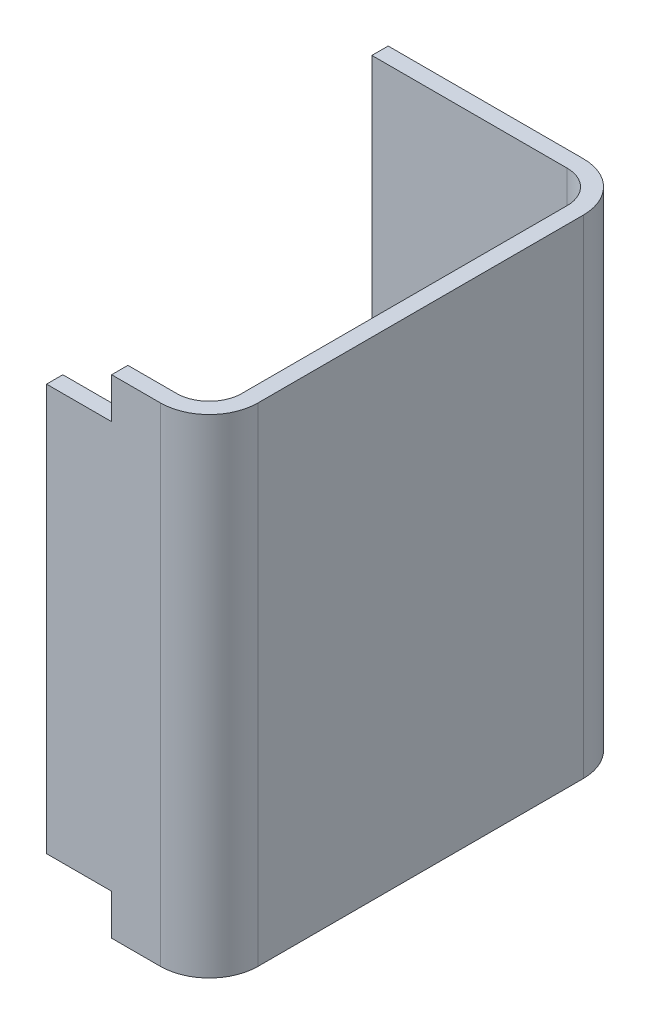
ISO-10303-21;
HEADER;
FILE_DESCRIPTION(('STEP AP214'),'2;1');
FILE_NAME('part.step','',(''),(''),'','','');
FILE_SCHEMA(('AUTOMOTIVE_DESIGN { 1 0 10303 214 1 1 1 1 }'));
ENDSEC;
DATA;
#1=APPLICATION_CONTEXT('core data for automotive mechanical design processes');
#2=APPLICATION_PROTOCOL_DEFINITION('international standard','automotive_design',2000,#1);
#3=PRODUCT_CONTEXT('',#1,'mechanical');
#4=PRODUCT('Part','Part','',(#3));
#5=PRODUCT_RELATED_PRODUCT_CATEGORY('part','',(#4));
#6=PRODUCT_DEFINITION_FORMATION('','',#4);
#7=PRODUCT_DEFINITION_CONTEXT('part definition',#1,'design');
#8=PRODUCT_DEFINITION('design','',#6,#7);
#9=PRODUCT_DEFINITION_SHAPE('','',#8);
#10=(LENGTH_UNIT() NAMED_UNIT(*) SI_UNIT(.MILLI.,.METRE.));
#11=(NAMED_UNIT(*) PLANE_ANGLE_UNIT() SI_UNIT($,.RADIAN.));
#12=(NAMED_UNIT(*) SI_UNIT($,.STERADIAN.) SOLID_ANGLE_UNIT());
#13=UNCERTAINTY_MEASURE_WITH_UNIT(LENGTH_MEASURE(1.E-05),#10,'distance_accuracy_value','');
#14=(GEOMETRIC_REPRESENTATION_CONTEXT(3) GLOBAL_UNCERTAINTY_ASSIGNED_CONTEXT((#13)) GLOBAL_UNIT_ASSIGNED_CONTEXT((#10,
#11,#12)) REPRESENTATION_CONTEXT('',''));
#15=CARTESIAN_POINT('',(0.,0.,0.));
#16=DIRECTION('',(0.,0.,1.));
#17=DIRECTION('',(1.,0.,0.));
#18=AXIS2_PLACEMENT_3D('',#15,#16,#17);
#19=CARTESIAN_POINT('',(0.2,-0.125,0.26));
#20=DIRECTION('',(0.,1.,0.));
#21=DIRECTION('',(1.,0.,0.));
#22=AXIS2_PLACEMENT_3D('',#19,#20,#21);
#23=PLANE('',#22);
#24=DIRECTION('',(-1.,0.,0.));
#25=VECTOR('',#24,1.);
#26=CARTESIAN_POINT('',(-0.045,-0.125,0.25));
#27=LINE('',#26,#25);
#28=CARTESIAN_POINT('',(0.24,-0.125,0.25));
#29=VERTEX_POINT('',#28);
#30=CARTESIAN_POINT('',(0.2,-0.125,0.25));
#31=VERTEX_POINT('',#30);
#32=EDGE_CURVE('E11',#29,#31,#27,.T.);
#33=ORIENTED_EDGE('',*,*,#32,.F.);
#34=DIRECTION('',(0.,0.,-1.));
#35=VECTOR('',#34,1.);
#36=CARTESIAN_POINT('',(0.24,-0.125,0.26));
#37=LINE('',#36,#35);
#38=CARTESIAN_POINT('',(0.24,-0.125,0.26));
#39=VERTEX_POINT('',#38);
#40=EDGE_CURVE('E24',#39,#29,#37,.T.);
#41=ORIENTED_EDGE('',*,*,#40,.F.);
#42=DIRECTION('',(1.,0.,0.));
#43=VECTOR('',#42,1.);
#44=CARTESIAN_POINT('',(0.1,-0.125,0.26));
#45=LINE('',#44,#43);
#46=CARTESIAN_POINT('',(0.2,-0.125,0.26));
#47=VERTEX_POINT('',#46);
#48=EDGE_CURVE('E260',#47,#39,#45,.T.);
#49=ORIENTED_EDGE('',*,*,#48,.F.);
#50=DIRECTION('',(0.,0.,1.));
#51=VECTOR('',#50,1.);
#52=CARTESIAN_POINT('',(0.2,-0.125,0.26));
#53=LINE('',#52,#51);
#54=EDGE_CURVE('E257',#31,#47,#53,.T.);
#55=ORIENTED_EDGE('',*,*,#54,.F.);
#56=EDGE_LOOP('',(#33,#41,#49,#55));
#57=FACE_BOUND('',#56,.T.);
#58=ADVANCED_FACE('F17',(#57),#23,.F.);
#59=CARTESIAN_POINT('',(0.24,-0.125,0.26));
#60=DIRECTION('',(1.,0.,0.));
#61=DIRECTION('',(0.,-1.,0.));
#62=AXIS2_PLACEMENT_3D('',#59,#60,#61);
#63=PLANE('',#62);
#64=DIRECTION('',(0.,1.,0.));
#65=VECTOR('',#64,1.);
#66=CARTESIAN_POINT('',(0.24,0.0125,0.25));
#67=LINE('',#66,#65);
#68=CARTESIAN_POINT('',(0.24,-0.15,0.25));
#69=VERTEX_POINT('',#68);
#70=EDGE_CURVE('E255',#69,#29,#67,.T.);
#71=ORIENTED_EDGE('',*,*,#70,.F.);
#72=DIRECTION('',(0.,0.,-1.));
#73=VECTOR('',#72,1.);
#74=CARTESIAN_POINT('',(0.24,-0.15,0.13));
#75=LINE('',#74,#73);
#76=CARTESIAN_POINT('',(0.24,-0.15,0.26));
#77=VERTEX_POINT('',#76);
#78=EDGE_CURVE('E252',#77,#69,#75,.T.);
#79=ORIENTED_EDGE('',*,*,#78,.F.);
#80=DIRECTION('',(0.,-1.,0.));
#81=VECTOR('',#80,1.);
#82=CARTESIAN_POINT('',(0.24,-0.0625,0.26));
#83=LINE('',#82,#81);
#84=EDGE_CURVE('E249',#39,#77,#83,.T.);
#85=ORIENTED_EDGE('',*,*,#84,.F.);
#86=ORIENTED_EDGE('',*,*,#40,.T.);
#87=EDGE_LOOP('',(#71,#79,#85,#86));
#88=FACE_BOUND('',#87,.T.);
#89=ADVANCED_FACE('F264',(#88),#63,.F.);
#90=CARTESIAN_POINT('',(0.24,0.125,0.26));
#91=DIRECTION('',(0.,-1.,0.));
#92=DIRECTION('',(-1.,0.,0.));
#93=AXIS2_PLACEMENT_3D('',#90,#91,#92);
#94=PLANE('',#93);
#95=DIRECTION('',(1.,0.,0.));
#96=VECTOR('',#95,1.);
#97=CARTESIAN_POINT('',(-0.025,0.125,0.25));
#98=LINE('',#97,#96);
#99=CARTESIAN_POINT('',(0.2,0.125,0.25));
#100=VERTEX_POINT('',#99);
#101=CARTESIAN_POINT('',(0.24,0.125,0.25));
#102=VERTEX_POINT('',#101);
#103=EDGE_CURVE('E247',#100,#102,#98,.T.);
#104=ORIENTED_EDGE('',*,*,#103,.F.);
#105=DIRECTION('',(0.,0.,-1.));
#106=VECTOR('',#105,1.);
#107=CARTESIAN_POINT('',(0.2,0.125,0.26));
#108=LINE('',#107,#106);
#109=CARTESIAN_POINT('',(0.2,0.125,0.26));
#110=VERTEX_POINT('',#109);
#111=EDGE_CURVE('E244',#110,#100,#108,.T.);
#112=ORIENTED_EDGE('',*,*,#111,.F.);
#113=DIRECTION('',(-1.,0.,0.));
#114=VECTOR('',#113,1.);
#115=CARTESIAN_POINT('',(0.12,0.125,0.26));
#116=LINE('',#115,#114);
#117=CARTESIAN_POINT('',(0.24,0.125,0.26));
#118=VERTEX_POINT('',#117);
#119=EDGE_CURVE('E241',#118,#110,#116,.T.);
#120=ORIENTED_EDGE('',*,*,#119,.F.);
#121=DIRECTION('',(0.,0.,-1.));
#122=VECTOR('',#121,1.);
#123=CARTESIAN_POINT('',(0.24,0.125,0.26));
#124=LINE('',#123,#122);
#125=EDGE_CURVE('E238',#118,#102,#124,.T.);
#126=ORIENTED_EDGE('',*,*,#125,.T.);
#127=EDGE_LOOP('',(#104,#112,#120,#126));
#128=FACE_BOUND('',#127,.T.);
#129=ADVANCED_FACE('F305',(#128),#94,.F.);
#130=CARTESIAN_POINT('',(0.24,0.15,0.26));
#131=DIRECTION('',(1.,0.,0.));
#132=DIRECTION('',(0.,-1.,0.));
#133=AXIS2_PLACEMENT_3D('',#130,#131,#132);
#134=PLANE('',#133);
#135=DIRECTION('',(0.,1.,0.));
#136=VECTOR('',#135,1.);
#137=CARTESIAN_POINT('',(0.24,0.149999999999999,0.25));
#138=LINE('',#137,#136);
#139=CARTESIAN_POINT('',(0.24,0.15,0.25));
#140=VERTEX_POINT('',#139);
#141=EDGE_CURVE('E236',#102,#140,#138,.T.);
#142=ORIENTED_EDGE('',*,*,#141,.F.);
#143=ORIENTED_EDGE('',*,*,#125,.F.);
#144=DIRECTION('',(0.,-1.,0.));
#145=VECTOR('',#144,1.);
#146=CARTESIAN_POINT('',(0.24,0.0749999999999997,0.26));
#147=LINE('',#146,#145);
#148=CARTESIAN_POINT('',(0.24,0.15,0.26));
#149=VERTEX_POINT('',#148);
#150=EDGE_CURVE('E233',#149,#118,#147,.T.);
#151=ORIENTED_EDGE('',*,*,#150,.F.);
#152=DIRECTION('',(0.,0.,1.));
#153=VECTOR('',#152,1.);
#154=CARTESIAN_POINT('',(0.24,0.15,0.13));
#155=LINE('',#154,#153);
#156=EDGE_CURVE('E231',#140,#149,#155,.T.);
#157=ORIENTED_EDGE('',*,*,#156,.F.);
#158=EDGE_LOOP('',(#142,#143,#151,#157));
#159=FACE_BOUND('',#158,.T.);
#160=ADVANCED_FACE('F307',(#159),#134,.F.);
#161=CARTESIAN_POINT('',(-0.3,-0.15,0.));
#162=DIRECTION('',(0.,-1.,0.));
#163=DIRECTION('',(1.,0.,0.));
#164=AXIS2_PLACEMENT_3D('',#161,#162,#163);
#165=PLANE('',#164);
#166=ORIENTED_EDGE('',*,*,#78,.T.);
#167=DIRECTION('',(1.,0.,0.));
#168=VECTOR('',#167,1.);
#169=CARTESIAN_POINT('',(-0.295,-0.15,0.25));
#170=LINE('',#169,#168);
#171=CARTESIAN_POINT('',(0.27,-0.15,0.25));
#172=VERTEX_POINT('',#171);
#173=EDGE_CURVE('E229',#69,#172,#170,.T.);
#174=ORIENTED_EDGE('',*,*,#173,.T.);
#175=CARTESIAN_POINT('',(0.27,-0.15,0.23));
#176=DIRECTION('',(0.,-1.,0.));
#177=DIRECTION('',(0.707106781186548,0.,0.707106781186548));
#178=AXIS2_PLACEMENT_3D('',#175,#176,#177);
#179=CIRCLE('',#178,0.02);
#180=CARTESIAN_POINT('',(0.29,-0.15,0.23));
#181=VERTEX_POINT('',#180);
#182=EDGE_CURVE('E226',#181,#172,#179,.T.);
#183=ORIENTED_EDGE('',*,*,#182,.F.);
#184=DIRECTION('',(0.,0.,-1.));
#185=VECTOR('',#184,1.);
#186=CARTESIAN_POINT('',(0.29,-0.15,0.125));
#187=LINE('',#186,#185);
#188=CARTESIAN_POINT('',(0.29,-0.15,0.03));
#189=VERTEX_POINT('',#188);
#190=EDGE_CURVE('E224',#181,#189,#187,.T.);
#191=ORIENTED_EDGE('',*,*,#190,.T.);
#192=CARTESIAN_POINT('',(0.27,-0.15,0.03));
#193=DIRECTION('',(0.,-1.,0.));
#194=DIRECTION('',(0.707106781186548,0.,-0.707106781186547));
#195=AXIS2_PLACEMENT_3D('',#192,#193,#194);
#196=CIRCLE('',#195,0.02);
#197=CARTESIAN_POINT('',(0.27,-0.15,0.01));
#198=VERTEX_POINT('',#197);
#199=EDGE_CURVE('E221',#198,#189,#196,.T.);
#200=ORIENTED_EDGE('',*,*,#199,.F.);
#201=DIRECTION('',(-1.,0.,0.));
#202=VECTOR('',#201,1.);
#203=CARTESIAN_POINT('',(-0.005,-0.15,0.0100000000000001));
#204=LINE('',#203,#202);
#205=CARTESIAN_POINT('',(0.15,-0.15,0.01));
#206=VERTEX_POINT('',#205);
#207=EDGE_CURVE('E219',#198,#206,#204,.T.);
#208=ORIENTED_EDGE('',*,*,#207,.T.);
#209=DIRECTION('',(0.,0.,-1.));
#210=VECTOR('',#209,1.);
#211=CARTESIAN_POINT('',(0.15,-0.15,0.));
#212=LINE('',#211,#210);
#213=CARTESIAN_POINT('',(0.15,-0.15,0.));
#214=VERTEX_POINT('',#213);
#215=EDGE_CURVE('E217',#206,#214,#212,.T.);
#216=ORIENTED_EDGE('',*,*,#215,.T.);
#217=DIRECTION('',(1.,0.,0.));
#218=VECTOR('',#217,1.);
#219=CARTESIAN_POINT('',(-0.3,-0.15,0.));
#220=LINE('',#219,#218);
#221=CARTESIAN_POINT('',(0.27,-0.15,0.));
#222=VERTEX_POINT('',#221);
#223=EDGE_CURVE('E144',#214,#222,#220,.T.);
#224=ORIENTED_EDGE('',*,*,#223,.T.);
#225=CARTESIAN_POINT('',(0.27,-0.15,0.03));
#226=DIRECTION('',(0.,1.,0.));
#227=DIRECTION('',(0.707106781186547,0.,-0.707106781186548));
#228=AXIS2_PLACEMENT_3D('',#225,#226,#227);
#229=CIRCLE('',#228,0.03);
#230=CARTESIAN_POINT('',(0.3,-0.15,0.03));
#231=VERTEX_POINT('',#230);
#232=EDGE_CURVE('E213',#231,#222,#229,.T.);
#233=ORIENTED_EDGE('',*,*,#232,.F.);
#234=DIRECTION('',(0.,0.,1.));
#235=VECTOR('',#234,1.);
#236=CARTESIAN_POINT('',(0.3,-0.15,0.));
#237=LINE('',#236,#235);
#238=CARTESIAN_POINT('',(0.3,-0.15,0.23));
#239=VERTEX_POINT('',#238);
#240=EDGE_CURVE('E211',#231,#239,#237,.T.);
#241=ORIENTED_EDGE('',*,*,#240,.T.);
#242=CARTESIAN_POINT('',(0.27,-0.15,0.23));
#243=DIRECTION('',(0.,1.,0.));
#244=DIRECTION('',(0.707106781186548,0.,0.707106781186548));
#245=AXIS2_PLACEMENT_3D('',#242,#243,#244);
#246=CIRCLE('',#245,0.03);
#247=CARTESIAN_POINT('',(0.27,-0.15,0.26));
#248=VERTEX_POINT('',#247);
#249=EDGE_CURVE('E208',#248,#239,#246,.T.);
#250=ORIENTED_EDGE('',*,*,#249,.F.);
#251=DIRECTION('',(1.,0.,0.));
#252=VECTOR('',#251,1.);
#253=CARTESIAN_POINT('',(-0.3,-0.15,0.26));
#254=LINE('',#253,#252);
#255=EDGE_CURVE('E205',#77,#248,#254,.T.);
#256=ORIENTED_EDGE('',*,*,#255,.F.);
#257=EDGE_LOOP('',(#166,#174,#183,#191,#200,#208,#216,#224,#233,#241,#250,#256));
#258=FACE_BOUND('',#257,.T.);
#259=ADVANCED_FACE('F270',(#258),#165,.T.);
#260=CARTESIAN_POINT('',(0.2,0.184006542055292,0.26));
#261=DIRECTION('',(1.,0.,0.));
#262=DIRECTION('',(0.,-1.,0.));
#263=AXIS2_PLACEMENT_3D('',#260,#261,#262);
#264=PLANE('',#263);
#265=ORIENTED_EDGE('',*,*,#54,.T.);
#266=DIRECTION('',(0.,-1.,0.));
#267=VECTOR('',#266,1.);
#268=CARTESIAN_POINT('',(0.2,0.0920032710276462,0.26));
#269=LINE('',#268,#267);
#270=EDGE_CURVE('E202',#110,#47,#269,.T.);
#271=ORIENTED_EDGE('',*,*,#270,.F.);
#272=ORIENTED_EDGE('',*,*,#111,.T.);
#273=DIRECTION('',(0.,-1.,0.));
#274=VECTOR('',#273,1.);
#275=CARTESIAN_POINT('',(0.2,-0.184006542055292,0.25));
#276=LINE('',#275,#274);
#277=EDGE_CURVE('E199',#100,#31,#276,.T.);
#278=ORIENTED_EDGE('',*,*,#277,.T.);
#279=EDGE_LOOP('',(#265,#271,#272,#278));
#280=FACE_BOUND('',#279,.T.);
#281=ADVANCED_FACE('F300',(#280),#264,.F.);
#282=CARTESIAN_POINT('',(0.27,-0.075,0.03));
#283=DIRECTION('',(0.,1.,0.));
#284=DIRECTION('',(0.707106781186547,0.,-0.707106781186548));
#285=AXIS2_PLACEMENT_3D('',#282,#283,#284);
#286=CYLINDRICAL_SURFACE('',#285,0.03);
#287=CARTESIAN_POINT('',(0.27,0.15,0.03));
#288=DIRECTION('',(0.,-1.,0.));
#289=DIRECTION('',(0.707106781186547,0.,-0.707106781186548));
#290=AXIS2_PLACEMENT_3D('',#287,#288,#289);
#291=CIRCLE('',#290,0.03);
#292=CARTESIAN_POINT('',(0.27,0.15,0.));
#293=VERTEX_POINT('',#292);
#294=CARTESIAN_POINT('',(0.3,0.15,0.03));
#295=VERTEX_POINT('',#294);
#296=EDGE_CURVE('E149',#293,#295,#291,.T.);
#297=ORIENTED_EDGE('',*,*,#296,.T.);
#298=DIRECTION('',(0.,-1.,0.));
#299=VECTOR('',#298,1.);
#300=CARTESIAN_POINT('',(0.3,-0.075,0.03));
#301=LINE('',#300,#299);
#302=EDGE_CURVE('E195',#295,#231,#301,.T.);
#303=ORIENTED_EDGE('',*,*,#302,.T.);
#304=ORIENTED_EDGE('',*,*,#232,.T.);
#305=DIRECTION('',(0.,1.,0.));
#306=VECTOR('',#305,1.);
#307=CARTESIAN_POINT('',(0.27,-0.075,0.));
#308=LINE('',#307,#306);
#309=EDGE_CURVE('E193',#222,#293,#308,.T.);
#310=ORIENTED_EDGE('',*,*,#309,.T.);
#311=EDGE_LOOP('',(#297,#303,#304,#310));
#312=FACE_BOUND('',#311,.T.);
#313=ADVANCED_FACE('F286',(#312),#286,.T.);
#314=CARTESIAN_POINT('',(0.3,-0.15,0.));
#315=DIRECTION('',(1.,0.,0.));
#316=DIRECTION('',(0.,1.,0.));
#317=AXIS2_PLACEMENT_3D('',#314,#315,#316);
#318=PLANE('',#317);
#319=ORIENTED_EDGE('',*,*,#302,.F.);
#320=DIRECTION('',(0.,0.,1.));
#321=VECTOR('',#320,1.);
#322=CARTESIAN_POINT('',(0.3,0.15,0.));
#323=LINE('',#322,#321);
#324=CARTESIAN_POINT('',(0.3,0.15,0.23));
#325=VERTEX_POINT('',#324);
#326=EDGE_CURVE('E191',#295,#325,#323,.T.);
#327=ORIENTED_EDGE('',*,*,#326,.T.);
#328=DIRECTION('',(0.,1.,0.));
#329=VECTOR('',#328,1.);
#330=CARTESIAN_POINT('',(0.3,-0.075,0.23));
#331=LINE('',#330,#329);
#332=EDGE_CURVE('E188',#239,#325,#331,.T.);
#333=ORIENTED_EDGE('',*,*,#332,.F.);
#334=ORIENTED_EDGE('',*,*,#240,.F.);
#335=EDGE_LOOP('',(#319,#327,#333,#334));
#336=FACE_BOUND('',#335,.T.);
#337=ADVANCED_FACE('F289',(#336),#318,.T.);
#338=CARTESIAN_POINT('',(0.27,-0.075,0.23));
#339=DIRECTION('',(0.,1.,0.));
#340=DIRECTION('',(0.707106781186548,0.,0.707106781186548));
#341=AXIS2_PLACEMENT_3D('',#338,#339,#340);
#342=CYLINDRICAL_SURFACE('',#341,0.03);
#343=CARTESIAN_POINT('',(0.27,0.15,0.23));
#344=DIRECTION('',(0.,-1.,0.));
#345=DIRECTION('',(0.707106781186548,0.,0.707106781186548));
#346=AXIS2_PLACEMENT_3D('',#343,#344,#345);
#347=CIRCLE('',#346,0.03);
#348=CARTESIAN_POINT('',(0.27,0.15,0.26));
#349=VERTEX_POINT('',#348);
#350=EDGE_CURVE('E186',#325,#349,#347,.T.);
#351=ORIENTED_EDGE('',*,*,#350,.T.);
#352=DIRECTION('',(0.,-1.,0.));
#353=VECTOR('',#352,1.);
#354=CARTESIAN_POINT('',(0.27,-0.075,0.26));
#355=LINE('',#354,#353);
#356=EDGE_CURVE('E183',#349,#248,#355,.T.);
#357=ORIENTED_EDGE('',*,*,#356,.T.);
#358=ORIENTED_EDGE('',*,*,#249,.T.);
#359=ORIENTED_EDGE('',*,*,#332,.T.);
#360=EDGE_LOOP('',(#351,#357,#358,#359));
#361=FACE_BOUND('',#360,.T.);
#362=ADVANCED_FACE('F295',(#361),#342,.T.);
#363=CARTESIAN_POINT('',(0.27,0.15,0.23));
#364=DIRECTION('',(0.,1.,0.));
#365=DIRECTION('',(0.707106781186548,0.,0.707106781186548));
#366=AXIS2_PLACEMENT_3D('',#363,#364,#365);
#367=CYLINDRICAL_SURFACE('',#366,0.02);
#368=ORIENTED_EDGE('',*,*,#182,.T.);
#369=DIRECTION('',(0.,1.,0.));
#370=VECTOR('',#369,1.);
#371=CARTESIAN_POINT('',(0.27,0.15,0.25));
#372=LINE('',#371,#370);
#373=CARTESIAN_POINT('',(0.27,0.15,0.25));
#374=VERTEX_POINT('',#373);
#375=EDGE_CURVE('E180',#172,#374,#372,.T.);
#376=ORIENTED_EDGE('',*,*,#375,.T.);
#377=CARTESIAN_POINT('',(0.27,0.15,0.23));
#378=DIRECTION('',(0.,1.,0.));
#379=DIRECTION('',(0.707106781186548,0.,0.707106781186548));
#380=AXIS2_PLACEMENT_3D('',#377,#378,#379);
#381=CIRCLE('',#380,0.02);
#382=CARTESIAN_POINT('',(0.29,0.15,0.23));
#383=VERTEX_POINT('',#382);
#384=EDGE_CURVE('E177',#374,#383,#381,.T.);
#385=ORIENTED_EDGE('',*,*,#384,.T.);
#386=DIRECTION('',(0.,-1.,0.));
#387=VECTOR('',#386,1.);
#388=CARTESIAN_POINT('',(0.29,0.15,0.23));
#389=LINE('',#388,#387);
#390=EDGE_CURVE('E174',#383,#181,#389,.T.);
#391=ORIENTED_EDGE('',*,*,#390,.T.);
#392=EDGE_LOOP('',(#368,#376,#385,#391));
#393=FACE_BOUND('',#392,.T.);
#394=ADVANCED_FACE('F274',(#393),#367,.F.);
#395=CARTESIAN_POINT('',(-0.29,0.15,0.25));
#396=DIRECTION('',(0.,0.,1.));
#397=DIRECTION('',(1.,0.,0.));
#398=AXIS2_PLACEMENT_3D('',#395,#396,#397);
#399=PLANE('',#398);
#400=ORIENTED_EDGE('',*,*,#32,.T.);
#401=ORIENTED_EDGE('',*,*,#277,.F.);
#402=ORIENTED_EDGE('',*,*,#103,.T.);
#403=ORIENTED_EDGE('',*,*,#141,.T.);
#404=DIRECTION('',(-1.,0.,0.));
#405=VECTOR('',#404,1.);
#406=CARTESIAN_POINT('',(0.00500000000000001,0.15,0.25));
#407=LINE('',#406,#405);
#408=EDGE_CURVE('E171',#374,#140,#407,.T.);
#409=ORIENTED_EDGE('',*,*,#408,.F.);
#410=ORIENTED_EDGE('',*,*,#375,.F.);
#411=ORIENTED_EDGE('',*,*,#173,.F.);
#412=ORIENTED_EDGE('',*,*,#70,.T.);
#413=EDGE_LOOP('',(#400,#401,#402,#403,#409,#410,#411,#412));
#414=FACE_BOUND('',#413,.T.);
#415=ADVANCED_FACE('F266',(#414),#399,.F.);
#416=CARTESIAN_POINT('',(0.27,0.15,0.03));
#417=DIRECTION('',(0.,1.,0.));
#418=DIRECTION('',(0.707106781186548,0.,-0.707106781186547));
#419=AXIS2_PLACEMENT_3D('',#416,#417,#418);
#420=CYLINDRICAL_SURFACE('',#419,0.02);
#421=ORIENTED_EDGE('',*,*,#199,.T.);
#422=DIRECTION('',(0.,1.,0.));
#423=VECTOR('',#422,1.);
#424=CARTESIAN_POINT('',(0.29,0.15,0.03));
#425=LINE('',#424,#423);
#426=CARTESIAN_POINT('',(0.29,0.15,0.03));
#427=VERTEX_POINT('',#426);
#428=EDGE_CURVE('E168',#189,#427,#425,.T.);
#429=ORIENTED_EDGE('',*,*,#428,.T.);
#430=CARTESIAN_POINT('',(0.27,0.15,0.03));
#431=DIRECTION('',(0.,1.,0.));
#432=DIRECTION('',(0.707106781186548,0.,-0.707106781186547));
#433=AXIS2_PLACEMENT_3D('',#430,#431,#432);
#434=CIRCLE('',#433,0.02);
#435=CARTESIAN_POINT('',(0.27,0.15,0.01));
#436=VERTEX_POINT('',#435);
#437=EDGE_CURVE('E165',#427,#436,#434,.T.);
#438=ORIENTED_EDGE('',*,*,#437,.T.);
#439=DIRECTION('',(0.,-1.,0.));
#440=VECTOR('',#439,1.);
#441=CARTESIAN_POINT('',(0.27,0.15,0.01));
#442=LINE('',#441,#440);
#443=EDGE_CURVE('E162',#436,#198,#442,.T.);
#444=ORIENTED_EDGE('',*,*,#443,.T.);
#445=EDGE_LOOP('',(#421,#429,#438,#444));
#446=FACE_BOUND('',#445,.T.);
#447=ADVANCED_FACE('F281',(#446),#420,.F.);
#448=CARTESIAN_POINT('',(0.29,0.15,0.25));
#449=DIRECTION('',(1.,0.,0.));
#450=DIRECTION('',(0.,0.,-1.));
#451=AXIS2_PLACEMENT_3D('',#448,#449,#450);
#452=PLANE('',#451);
#453=ORIENTED_EDGE('',*,*,#390,.F.);
#454=DIRECTION('',(0.,0.,1.));
#455=VECTOR('',#454,1.);
#456=CARTESIAN_POINT('',(0.29,0.15,0.125));
#457=LINE('',#456,#455);
#458=EDGE_CURVE('E159',#427,#383,#457,.T.);
#459=ORIENTED_EDGE('',*,*,#458,.F.);
#460=ORIENTED_EDGE('',*,*,#428,.F.);
#461=ORIENTED_EDGE('',*,*,#190,.F.);
#462=EDGE_LOOP('',(#453,#459,#460,#461));
#463=FACE_BOUND('',#462,.T.);
#464=ADVANCED_FACE('F277',(#463),#452,.F.);
#465=CARTESIAN_POINT('',(0.29,0.15,0.01));
#466=DIRECTION('',(0.,0.,-1.));
#467=DIRECTION('',(-1.,0.,0.));
#468=AXIS2_PLACEMENT_3D('',#465,#466,#467);
#469=PLANE('',#468);
#470=ORIENTED_EDGE('',*,*,#207,.F.);
#471=ORIENTED_EDGE('',*,*,#443,.F.);
#472=DIRECTION('',(1.,0.,0.));
#473=VECTOR('',#472,1.);
#474=CARTESIAN_POINT('',(0.295,0.15,0.01));
#475=LINE('',#474,#473);
#476=CARTESIAN_POINT('',(0.15,0.15,0.01));
#477=VERTEX_POINT('',#476);
#478=EDGE_CURVE('E157',#477,#436,#475,.T.);
#479=ORIENTED_EDGE('',*,*,#478,.F.);
#480=DIRECTION('',(0.,1.,0.));
#481=VECTOR('',#480,1.);
#482=CARTESIAN_POINT('',(0.15,-0.187514999002179,0.01));
#483=LINE('',#482,#481);
#484=EDGE_CURVE('E133',#206,#477,#483,.T.);
#485=ORIENTED_EDGE('',*,*,#484,.F.);
#486=EDGE_LOOP('',(#470,#471,#479,#485));
#487=FACE_BOUND('',#486,.T.);
#488=ADVANCED_FACE('F283',(#487),#469,.F.);
#489=CARTESIAN_POINT('',(0.15,-0.187514999002179,0.));
#490=DIRECTION('',(1.,0.,0.));
#491=DIRECTION('',(0.,1.,0.));
#492=AXIS2_PLACEMENT_3D('',#489,#490,#491);
#493=PLANE('',#492);
#494=ORIENTED_EDGE('',*,*,#215,.F.);
#495=ORIENTED_EDGE('',*,*,#484,.T.);
#496=DIRECTION('',(0.,0.,1.));
#497=VECTOR('',#496,1.);
#498=CARTESIAN_POINT('',(0.15,0.15,0.));
#499=LINE('',#498,#497);
#500=CARTESIAN_POINT('',(0.15,0.15,0.));
#501=VERTEX_POINT('',#500);
#502=EDGE_CURVE('E127',#501,#477,#499,.T.);
#503=ORIENTED_EDGE('',*,*,#502,.F.);
#504=DIRECTION('',(0.,1.,0.));
#505=VECTOR('',#504,1.);
#506=CARTESIAN_POINT('',(0.15,-0.0937574995010894,0.));
#507=LINE('',#506,#505);
#508=EDGE_CURVE('E131',#214,#501,#507,.T.);
#509=ORIENTED_EDGE('',*,*,#508,.F.);
#510=EDGE_LOOP('',(#494,#495,#503,#509));
#511=FACE_BOUND('',#510,.T.);
#512=ADVANCED_FACE('F130',(#511),#493,.F.);
#513=CARTESIAN_POINT('',(0.,0.,0.));
#514=DIRECTION('',(0.,0.,1.));
#515=DIRECTION('',(1.,0.,0.));
#516=AXIS2_PLACEMENT_3D('',#513,#514,#515);
#517=PLANE('',#516);
#518=ORIENTED_EDGE('',*,*,#309,.F.);
#519=ORIENTED_EDGE('',*,*,#223,.F.);
#520=ORIENTED_EDGE('',*,*,#508,.T.);
#521=DIRECTION('',(-1.,0.,0.));
#522=VECTOR('',#521,1.);
#523=CARTESIAN_POINT('',(0.3,0.15,0.));
#524=LINE('',#523,#522);
#525=EDGE_CURVE('E143',#293,#501,#524,.T.);
#526=ORIENTED_EDGE('',*,*,#525,.F.);
#527=EDGE_LOOP('',(#518,#519,#520,#526));
#528=FACE_BOUND('',#527,.T.);
#529=ADVANCED_FACE('F142',(#528),#517,.F.);
#530=CARTESIAN_POINT('',(0.3,0.15,0.));
#531=DIRECTION('',(0.,1.,0.));
#532=DIRECTION('',(-1.,0.,0.));
#533=AXIS2_PLACEMENT_3D('',#530,#531,#532);
#534=PLANE('',#533);
#535=ORIENTED_EDGE('',*,*,#156,.T.);
#536=DIRECTION('',(-1.,0.,0.));
#537=VECTOR('',#536,1.);
#538=CARTESIAN_POINT('',(0.3,0.15,0.26));
#539=LINE('',#538,#537);
#540=EDGE_CURVE('E151',#349,#149,#539,.T.);
#541=ORIENTED_EDGE('',*,*,#540,.F.);
#542=ORIENTED_EDGE('',*,*,#350,.F.);
#543=ORIENTED_EDGE('',*,*,#326,.F.);
#544=ORIENTED_EDGE('',*,*,#296,.F.);
#545=ORIENTED_EDGE('',*,*,#525,.T.);
#546=ORIENTED_EDGE('',*,*,#502,.T.);
#547=ORIENTED_EDGE('',*,*,#478,.T.);
#548=ORIENTED_EDGE('',*,*,#437,.F.);
#549=ORIENTED_EDGE('',*,*,#458,.T.);
#550=ORIENTED_EDGE('',*,*,#384,.F.);
#551=ORIENTED_EDGE('',*,*,#408,.T.);
#552=EDGE_LOOP('',(#535,#541,#542,#543,#544,#545,#546,#547,#548,#549,#550,#551));
#553=FACE_BOUND('',#552,.T.);
#554=ADVANCED_FACE('F147',(#553),#534,.T.);
#555=CARTESIAN_POINT('',(0.,0.,0.26));
#556=DIRECTION('',(0.,0.,1.));
#557=DIRECTION('',(1.,0.,0.));
#558=AXIS2_PLACEMENT_3D('',#555,#556,#557);
#559=PLANE('',#558);
#560=ORIENTED_EDGE('',*,*,#84,.T.);
#561=ORIENTED_EDGE('',*,*,#255,.T.);
#562=ORIENTED_EDGE('',*,*,#356,.F.);
#563=ORIENTED_EDGE('',*,*,#540,.T.);
#564=ORIENTED_EDGE('',*,*,#150,.T.);
#565=ORIENTED_EDGE('',*,*,#119,.T.);
#566=ORIENTED_EDGE('',*,*,#270,.T.);
#567=ORIENTED_EDGE('',*,*,#48,.T.);
#568=EDGE_LOOP('',(#560,#561,#562,#563,#564,#565,#566,#567));
#569=FACE_BOUND('',#568,.T.);
#570=ADVANCED_FACE('F297',(#569),#559,.T.);
#571=CLOSED_SHELL('',(#58,#89,#129,#160,#259,#281,#313,#337,#362,#394,#415,#447,#464,#488,#512,
#529,#554,#570));
#572=MANIFOLD_SOLID_BREP('B1',#571);
#573=ADVANCED_BREP_SHAPE_REPRESENTATION('',(#18,#572),#14);
#574=SHAPE_DEFINITION_REPRESENTATION(#9,#573);
ENDSEC;
END-ISO-10303-21;
